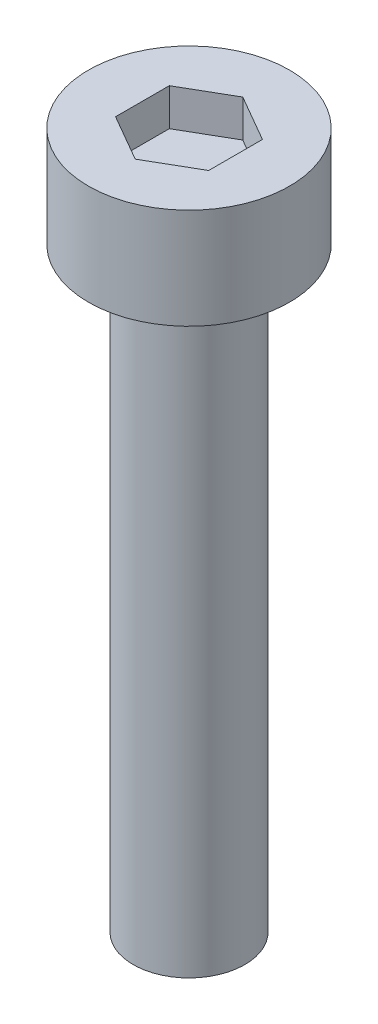
ISO-10303-21;
HEADER;
FILE_DESCRIPTION(('STEP AP214'),'2;1');
FILE_NAME('part.step','',(''),(''),'','','');
FILE_SCHEMA(('AUTOMOTIVE_DESIGN { 1 0 10303 214 1 1 1 1 }'));
ENDSEC;
DATA;
#1=APPLICATION_CONTEXT('core data for automotive mechanical design processes');
#2=APPLICATION_PROTOCOL_DEFINITION('international standard','automotive_design',2000,#1);
#3=PRODUCT_CONTEXT('',#1,'mechanical');
#4=PRODUCT('Part','Part','',(#3));
#5=PRODUCT_RELATED_PRODUCT_CATEGORY('part','',(#4));
#6=PRODUCT_DEFINITION_FORMATION('','',#4);
#7=PRODUCT_DEFINITION_CONTEXT('part definition',#1,'design');
#8=PRODUCT_DEFINITION('design','',#6,#7);
#9=PRODUCT_DEFINITION_SHAPE('','',#8);
#10=(LENGTH_UNIT() NAMED_UNIT(*) SI_UNIT(.MILLI.,.METRE.));
#11=(NAMED_UNIT(*) PLANE_ANGLE_UNIT() SI_UNIT($,.RADIAN.));
#12=(NAMED_UNIT(*) SI_UNIT($,.STERADIAN.) SOLID_ANGLE_UNIT());
#13=UNCERTAINTY_MEASURE_WITH_UNIT(LENGTH_MEASURE(1.E-05),#10,'distance_accuracy_value','');
#14=(GEOMETRIC_REPRESENTATION_CONTEXT(3) GLOBAL_UNCERTAINTY_ASSIGNED_CONTEXT((#13)) GLOBAL_UNIT_ASSIGNED_CONTEXT((#10,
#11,#12)) REPRESENTATION_CONTEXT('',''));
#15=CARTESIAN_POINT('',(0.,0.,0.));
#16=DIRECTION('',(0.,0.,1.));
#17=DIRECTION('',(1.,0.,0.));
#18=AXIS2_PLACEMENT_3D('',#15,#16,#17);
#19=CARTESIAN_POINT('',(0.,2.7,0.));
#20=DIRECTION('',(0.,-1.,0.));
#21=DIRECTION('',(0.,0.,-1.));
#22=AXIS2_PLACEMENT_3D('',#19,#20,#21);
#23=CYLINDRICAL_SURFACE('',#22,2.7);
#24=CARTESIAN_POINT('',(0.,2.7,0.));
#25=DIRECTION('',(0.,1.,0.));
#26=DIRECTION('',(0.,0.,1.));
#27=AXIS2_PLACEMENT_3D('',#24,#25,#26);
#28=CIRCLE('',#27,2.7);
#29=CARTESIAN_POINT('',(0.,2.7,2.7));
#30=VERTEX_POINT('',#29);
#31=EDGE_CURVE('E44',#30,#30,#28,.T.);
#32=ORIENTED_EDGE('',*,*,#31,.F.);
#33=EDGE_LOOP('',(#32));
#34=FACE_BOUND('',#33,.T.);
#35=CARTESIAN_POINT('',(0.,0.,0.));
#36=DIRECTION('',(0.,1.,0.));
#37=DIRECTION('',(0.,0.,1.));
#38=AXIS2_PLACEMENT_3D('',#35,#36,#37);
#39=CIRCLE('',#38,2.7);
#40=CARTESIAN_POINT('',(0.,0.,2.7));
#41=VERTEX_POINT('',#40);
#42=EDGE_CURVE('E39',#41,#41,#39,.T.);
#43=ORIENTED_EDGE('',*,*,#42,.T.);
#44=EDGE_LOOP('',(#43));
#45=FACE_BOUND('',#44,.T.);
#46=ADVANCED_FACE('F36',(#34,#45),#23,.T.);
#47=CARTESIAN_POINT('',(0.,2.7,0.));
#48=DIRECTION('',(0.,1.,0.));
#49=DIRECTION('',(0.,0.,1.));
#50=AXIS2_PLACEMENT_3D('',#47,#48,#49);
#51=PLANE('',#50);
#52=DIRECTION('',(-0.866025403784439,0.,-0.5));
#53=VECTOR('',#52,1.);
#54=CARTESIAN_POINT('',(1.25,2.7,-0.721687836487033));
#55=LINE('',#54,#53);
#56=CARTESIAN_POINT('',(1.25,2.7,-0.721687836487033));
#57=VERTEX_POINT('',#56);
#58=CARTESIAN_POINT('',(0.,2.7,-1.44337567297407));
#59=VERTEX_POINT('',#58);
#60=EDGE_CURVE('E52',#57,#59,#55,.T.);
#61=ORIENTED_EDGE('',*,*,#60,.F.);
#62=DIRECTION('',(0.,0.,-1.));
#63=VECTOR('',#62,1.);
#64=CARTESIAN_POINT('',(1.25,2.7,0.721687836487031));
#65=LINE('',#64,#63);
#66=CARTESIAN_POINT('',(1.25,2.7,0.721687836487031));
#67=VERTEX_POINT('',#66);
#68=EDGE_CURVE('E136',#67,#57,#65,.T.);
#69=ORIENTED_EDGE('',*,*,#68,.F.);
#70=DIRECTION('',(0.866025403784439,0.,-0.5));
#71=VECTOR('',#70,1.);
#72=CARTESIAN_POINT('',(0.,2.7,1.44337567297406));
#73=LINE('',#72,#71);
#74=CARTESIAN_POINT('',(0.,2.7,1.44337567297406));
#75=VERTEX_POINT('',#74);
#76=EDGE_CURVE('E134',#75,#67,#73,.T.);
#77=ORIENTED_EDGE('',*,*,#76,.F.);
#78=DIRECTION('',(0.866025403784438,0.,0.5));
#79=VECTOR('',#78,1.);
#80=CARTESIAN_POINT('',(-1.25,2.7,0.721687836487032));
#81=LINE('',#80,#79);
#82=CARTESIAN_POINT('',(-1.25,2.7,0.721687836487032));
#83=VERTEX_POINT('',#82);
#84=EDGE_CURVE('E100',#83,#75,#81,.T.);
#85=ORIENTED_EDGE('',*,*,#84,.F.);
#86=DIRECTION('',(0.,0.,1.));
#87=VECTOR('',#86,1.);
#88=CARTESIAN_POINT('',(-1.25,2.7,-0.721687836487032));
#89=LINE('',#88,#87);
#90=CARTESIAN_POINT('',(-1.25,2.7,-0.721687836487032));
#91=VERTEX_POINT('',#90);
#92=EDGE_CURVE('E130',#91,#83,#89,.T.);
#93=ORIENTED_EDGE('',*,*,#92,.F.);
#94=DIRECTION('',(-0.866025403784439,0.,0.5));
#95=VECTOR('',#94,1.);
#96=CARTESIAN_POINT('',(0.,2.7,-1.44337567297407));
#97=LINE('',#96,#95);
#98=EDGE_CURVE('E126',#59,#91,#97,.T.);
#99=ORIENTED_EDGE('',*,*,#98,.F.);
#100=EDGE_LOOP('',(#61,#69,#77,#85,#93,#99));
#101=FACE_BOUND('',#100,.T.);
#102=ORIENTED_EDGE('',*,*,#31,.T.);
#103=EDGE_LOOP('',(#102));
#104=FACE_BOUND('',#103,.T.);
#105=ADVANCED_FACE('F154',(#101,#104),#51,.T.);
#106=CARTESIAN_POINT('',(0.,0.,0.));
#107=DIRECTION('',(0.,1.,0.));
#108=DIRECTION('',(0.,0.,1.));
#109=AXIS2_PLACEMENT_3D('',#106,#107,#108);
#110=PLANE('',#109);
#111=CARTESIAN_POINT('',(0.,0.,0.));
#112=DIRECTION('',(0.,-1.,0.));
#113=DIRECTION('',(0.,0.,-1.));
#114=AXIS2_PLACEMENT_3D('',#111,#112,#113);
#115=CIRCLE('',#114,1.5);
#116=CARTESIAN_POINT('',(0.,0.,-1.5));
#117=VERTEX_POINT('',#116);
#118=EDGE_CURVE('E11',#117,#117,#115,.T.);
#119=ORIENTED_EDGE('',*,*,#118,.F.);
#120=EDGE_LOOP('',(#119));
#121=FACE_BOUND('',#120,.T.);
#122=ORIENTED_EDGE('',*,*,#42,.F.);
#123=EDGE_LOOP('',(#122));
#124=FACE_BOUND('',#123,.T.);
#125=ADVANCED_FACE('F151',(#121,#124),#110,.F.);
#126=CARTESIAN_POINT('',(1.25,1.7,-0.721687836487033));
#127=DIRECTION('',(0.5,0.,-0.866025403784439));
#128=DIRECTION('',(-0.866025403784439,0.,-0.5));
#129=AXIS2_PLACEMENT_3D('',#126,#127,#128);
#130=PLANE('',#129);
#131=ORIENTED_EDGE('',*,*,#60,.T.);
#132=DIRECTION('',(0.,1.,0.));
#133=VECTOR('',#132,1.);
#134=CARTESIAN_POINT('',(0.,1.7,-1.44337567297407));
#135=LINE('',#134,#133);
#136=CARTESIAN_POINT('',(0.,1.7,-1.44337567297407));
#137=VERTEX_POINT('',#136);
#138=EDGE_CURVE('E82',#137,#59,#135,.T.);
#139=ORIENTED_EDGE('',*,*,#138,.F.);
#140=DIRECTION('',(-0.866025403784439,0.,-0.5));
#141=VECTOR('',#140,1.);
#142=CARTESIAN_POINT('',(1.25,1.7,-0.721687836487033));
#143=LINE('',#142,#141);
#144=CARTESIAN_POINT('',(1.25,1.7,-0.721687836487033));
#145=VERTEX_POINT('',#144);
#146=EDGE_CURVE('E138',#145,#137,#143,.T.);
#147=ORIENTED_EDGE('',*,*,#146,.F.);
#148=DIRECTION('',(0.,1.,0.));
#149=VECTOR('',#148,1.);
#150=CARTESIAN_POINT('',(1.25,1.7,-0.721687836487033));
#151=LINE('',#150,#149);
#152=EDGE_CURVE('E60',#145,#57,#151,.T.);
#153=ORIENTED_EDGE('',*,*,#152,.T.);
#154=EDGE_LOOP('',(#131,#139,#147,#153));
#155=FACE_BOUND('',#154,.T.);
#156=ADVANCED_FACE('F153',(#155),#130,.F.);
#157=CARTESIAN_POINT('',(1.25,1.7,0.721687836487031));
#158=DIRECTION('',(1.,0.,0.));
#159=DIRECTION('',(0.,0.,-1.));
#160=AXIS2_PLACEMENT_3D('',#157,#158,#159);
#161=PLANE('',#160);
#162=ORIENTED_EDGE('',*,*,#68,.T.);
#163=ORIENTED_EDGE('',*,*,#152,.F.);
#164=DIRECTION('',(0.,0.,-1.));
#165=VECTOR('',#164,1.);
#166=CARTESIAN_POINT('',(1.25,1.7,0.721687836487031));
#167=LINE('',#166,#165);
#168=CARTESIAN_POINT('',(1.25,1.7,0.721687836487031));
#169=VERTEX_POINT('',#168);
#170=EDGE_CURVE('E112',#169,#145,#167,.T.);
#171=ORIENTED_EDGE('',*,*,#170,.F.);
#172=DIRECTION('',(0.,1.,0.));
#173=VECTOR('',#172,1.);
#174=CARTESIAN_POINT('',(1.25,1.7,0.721687836487031));
#175=LINE('',#174,#173);
#176=EDGE_CURVE('E104',#169,#67,#175,.T.);
#177=ORIENTED_EDGE('',*,*,#176,.T.);
#178=EDGE_LOOP('',(#162,#163,#171,#177));
#179=FACE_BOUND('',#178,.T.);
#180=ADVANCED_FACE('F160',(#179),#161,.F.);
#181=CARTESIAN_POINT('',(0.,1.7,1.44337567297406));
#182=DIRECTION('',(0.5,0.,0.866025403784439));
#183=DIRECTION('',(0.866025403784439,0.,-0.5));
#184=AXIS2_PLACEMENT_3D('',#181,#182,#183);
#185=PLANE('',#184);
#186=ORIENTED_EDGE('',*,*,#76,.T.);
#187=ORIENTED_EDGE('',*,*,#176,.F.);
#188=DIRECTION('',(0.866025403784439,0.,-0.5));
#189=VECTOR('',#188,1.);
#190=CARTESIAN_POINT('',(0.,1.7,1.44337567297406));
#191=LINE('',#190,#189);
#192=CARTESIAN_POINT('',(0.,1.7,1.44337567297406));
#193=VERTEX_POINT('',#192);
#194=EDGE_CURVE('E108',#193,#169,#191,.T.);
#195=ORIENTED_EDGE('',*,*,#194,.F.);
#196=DIRECTION('',(0.,1.,0.));
#197=VECTOR('',#196,1.);
#198=CARTESIAN_POINT('',(0.,1.7,1.44337567297406));
#199=LINE('',#198,#197);
#200=EDGE_CURVE('E93',#193,#75,#199,.T.);
#201=ORIENTED_EDGE('',*,*,#200,.T.);
#202=EDGE_LOOP('',(#186,#187,#195,#201));
#203=FACE_BOUND('',#202,.T.);
#204=ADVANCED_FACE('F109',(#203),#185,.F.);
#205=CARTESIAN_POINT('',(-1.25,1.7,0.721687836487032));
#206=DIRECTION('',(-0.5,0.,0.866025403784438));
#207=DIRECTION('',(0.866025403784438,0.,0.5));
#208=AXIS2_PLACEMENT_3D('',#205,#206,#207);
#209=PLANE('',#208);
#210=ORIENTED_EDGE('',*,*,#84,.T.);
#211=ORIENTED_EDGE('',*,*,#200,.F.);
#212=DIRECTION('',(0.866025403784438,0.,0.5));
#213=VECTOR('',#212,1.);
#214=CARTESIAN_POINT('',(-1.25,1.7,0.721687836487032));
#215=LINE('',#214,#213);
#216=CARTESIAN_POINT('',(-1.25,1.7,0.721687836487032));
#217=VERTEX_POINT('',#216);
#218=EDGE_CURVE('E97',#217,#193,#215,.T.);
#219=ORIENTED_EDGE('',*,*,#218,.F.);
#220=DIRECTION('',(0.,1.,0.));
#221=VECTOR('',#220,1.);
#222=CARTESIAN_POINT('',(-1.25,1.7,0.721687836487032));
#223=LINE('',#222,#221);
#224=EDGE_CURVE('E105',#217,#83,#223,.T.);
#225=ORIENTED_EDGE('',*,*,#224,.T.);
#226=EDGE_LOOP('',(#210,#211,#219,#225));
#227=FACE_BOUND('',#226,.T.);
#228=ADVANCED_FACE('F95',(#227),#209,.F.);
#229=CARTESIAN_POINT('',(-1.25,1.7,-0.721687836487032));
#230=DIRECTION('',(-1.,0.,0.));
#231=DIRECTION('',(0.,0.,1.));
#232=AXIS2_PLACEMENT_3D('',#229,#230,#231);
#233=PLANE('',#232);
#234=ORIENTED_EDGE('',*,*,#92,.T.);
#235=ORIENTED_EDGE('',*,*,#224,.F.);
#236=DIRECTION('',(0.,0.,1.));
#237=VECTOR('',#236,1.);
#238=CARTESIAN_POINT('',(-1.25,1.7,-0.721687836487032));
#239=LINE('',#238,#237);
#240=CARTESIAN_POINT('',(-1.25,1.7,-0.721687836487032));
#241=VERTEX_POINT('',#240);
#242=EDGE_CURVE('E118',#241,#217,#239,.T.);
#243=ORIENTED_EDGE('',*,*,#242,.F.);
#244=DIRECTION('',(0.,1.,0.));
#245=VECTOR('',#244,1.);
#246=CARTESIAN_POINT('',(-1.25,1.7,-0.721687836487032));
#247=LINE('',#246,#245);
#248=EDGE_CURVE('E142',#241,#91,#247,.T.);
#249=ORIENTED_EDGE('',*,*,#248,.T.);
#250=EDGE_LOOP('',(#234,#235,#243,#249));
#251=FACE_BOUND('',#250,.T.);
#252=ADVANCED_FACE('F209',(#251),#233,.F.);
#253=CARTESIAN_POINT('',(0.,1.7,-1.44337567297407));
#254=DIRECTION('',(-0.5,0.,-0.866025403784439));
#255=DIRECTION('',(-0.866025403784439,0.,0.5));
#256=AXIS2_PLACEMENT_3D('',#253,#254,#255);
#257=PLANE('',#256);
#258=ORIENTED_EDGE('',*,*,#98,.T.);
#259=ORIENTED_EDGE('',*,*,#248,.F.);
#260=DIRECTION('',(-0.866025403784439,0.,0.5));
#261=VECTOR('',#260,1.);
#262=CARTESIAN_POINT('',(0.,1.7,-1.44337567297407));
#263=LINE('',#262,#261);
#264=EDGE_CURVE('E120',#137,#241,#263,.T.);
#265=ORIENTED_EDGE('',*,*,#264,.F.);
#266=ORIENTED_EDGE('',*,*,#138,.T.);
#267=EDGE_LOOP('',(#258,#259,#265,#266));
#268=FACE_BOUND('',#267,.T.);
#269=ADVANCED_FACE('F219',(#268),#257,.F.);
#270=CARTESIAN_POINT('',(0.,1.7,0.));
#271=DIRECTION('',(0.,1.,0.));
#272=DIRECTION('',(0.,0.,1.));
#273=AXIS2_PLACEMENT_3D('',#270,#271,#272);
#274=PLANE('',#273);
#275=ORIENTED_EDGE('',*,*,#146,.T.);
#276=ORIENTED_EDGE('',*,*,#264,.T.);
#277=ORIENTED_EDGE('',*,*,#242,.T.);
#278=ORIENTED_EDGE('',*,*,#218,.T.);
#279=ORIENTED_EDGE('',*,*,#194,.T.);
#280=ORIENTED_EDGE('',*,*,#170,.T.);
#281=EDGE_LOOP('',(#275,#276,#277,#278,#279,#280));
#282=FACE_BOUND('',#281,.T.);
#283=ADVANCED_FACE('F115',(#282),#274,.T.);
#284=CARTESIAN_POINT('',(0.,-16.,0.));
#285=DIRECTION('',(0.,1.,0.));
#286=DIRECTION('',(0.,0.,1.));
#287=AXIS2_PLACEMENT_3D('',#284,#285,#286);
#288=CYLINDRICAL_SURFACE('',#287,1.5);
#289=CARTESIAN_POINT('',(0.,-16.,0.));
#290=DIRECTION('',(0.,-1.,0.));
#291=DIRECTION('',(0.,0.,-1.));
#292=AXIS2_PLACEMENT_3D('',#289,#290,#291);
#293=CIRCLE('',#292,1.5);
#294=CARTESIAN_POINT('',(0.,-16.,-1.5));
#295=VERTEX_POINT('',#294);
#296=EDGE_CURVE('E127',#295,#295,#293,.T.);
#297=ORIENTED_EDGE('',*,*,#296,.F.);
#298=EDGE_LOOP('',(#297));
#299=FACE_BOUND('',#298,.T.);
#300=ORIENTED_EDGE('',*,*,#118,.T.);
#301=EDGE_LOOP('',(#300));
#302=FACE_BOUND('',#301,.T.);
#303=ADVANCED_FACE('F239',(#299,#302),#288,.T.);
#304=CARTESIAN_POINT('',(0.,-16.,0.));
#305=DIRECTION('',(0.,-1.,0.));
#306=DIRECTION('',(0.,0.,-1.));
#307=AXIS2_PLACEMENT_3D('',#304,#305,#306);
#308=PLANE('',#307);
#309=ORIENTED_EDGE('',*,*,#296,.T.);
#310=EDGE_LOOP('',(#309));
#311=FACE_BOUND('',#310,.T.);
#312=ADVANCED_FACE('F254',(#311),#308,.T.);
#313=CLOSED_SHELL('',(#46,#105,#125,#156,#180,#204,#228,#252,#269,#283,#303,#312));
#314=MANIFOLD_SOLID_BREP('B2',#313);
#315=ADVANCED_BREP_SHAPE_REPRESENTATION('',(#18,#314),#14);
#316=SHAPE_DEFINITION_REPRESENTATION(#9,#315);
ENDSEC;
END-ISO-10303-21;
